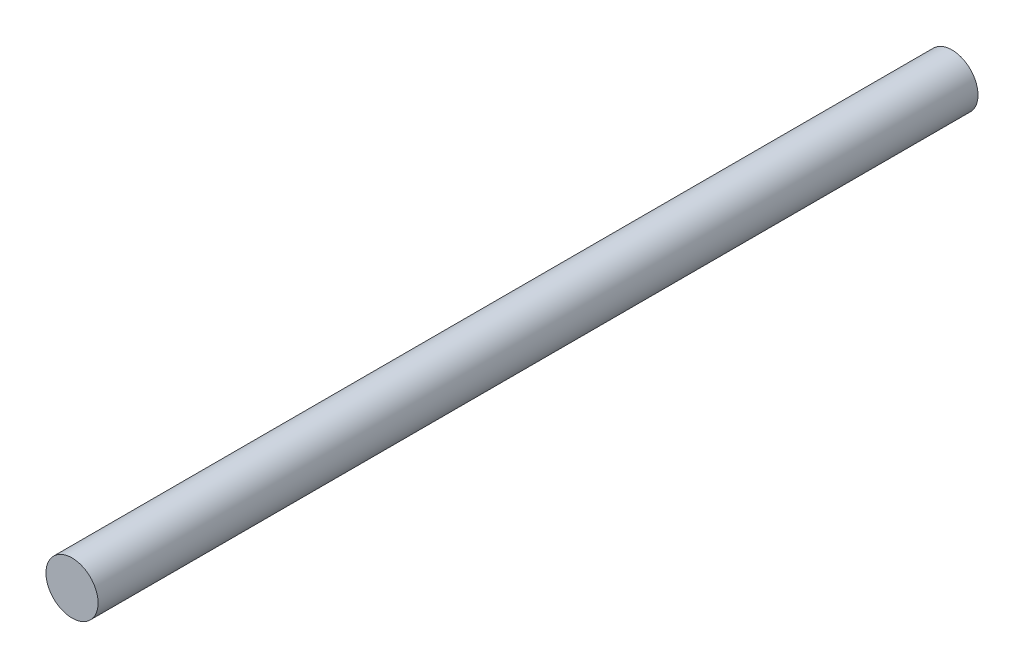
ISO-10303-21;
HEADER;
FILE_DESCRIPTION(('STEP AP214'),'2;1');
FILE_NAME('part.step','',(''),(''),'','','');
FILE_SCHEMA(('AUTOMOTIVE_DESIGN { 1 0 10303 214 1 1 1 1 }'));
ENDSEC;
DATA;
#1=APPLICATION_CONTEXT('core data for automotive mechanical design processes');
#2=APPLICATION_PROTOCOL_DEFINITION('international standard','automotive_design',2000,#1);
#3=PRODUCT_CONTEXT('',#1,'mechanical');
#4=PRODUCT('Part','Part','',(#3));
#5=PRODUCT_RELATED_PRODUCT_CATEGORY('part','',(#4));
#6=PRODUCT_DEFINITION_FORMATION('','',#4);
#7=PRODUCT_DEFINITION_CONTEXT('part definition',#1,'design');
#8=PRODUCT_DEFINITION('design','',#6,#7);
#9=PRODUCT_DEFINITION_SHAPE('','',#8);
#10=(LENGTH_UNIT() NAMED_UNIT(*) SI_UNIT(.MILLI.,.METRE.));
#11=(NAMED_UNIT(*) PLANE_ANGLE_UNIT() SI_UNIT($,.RADIAN.));
#12=(NAMED_UNIT(*) SI_UNIT($,.STERADIAN.) SOLID_ANGLE_UNIT());
#13=UNCERTAINTY_MEASURE_WITH_UNIT(LENGTH_MEASURE(1.E-05),#10,'distance_accuracy_value','');
#14=(GEOMETRIC_REPRESENTATION_CONTEXT(3) GLOBAL_UNCERTAINTY_ASSIGNED_CONTEXT((#13)) GLOBAL_UNIT_ASSIGNED_CONTEXT((#10,
#11,#12)) REPRESENTATION_CONTEXT('',''));
#15=CARTESIAN_POINT('',(0.,0.,0.));
#16=DIRECTION('',(0.,0.,1.));
#17=DIRECTION('',(1.,0.,0.));
#18=AXIS2_PLACEMENT_3D('',#15,#16,#17);
#19=CARTESIAN_POINT('',(0.,0.,135.));
#20=DIRECTION('',(0.,0.,-1.));
#21=DIRECTION('',(-1.,0.,0.));
#22=AXIS2_PLACEMENT_3D('',#19,#20,#21);
#23=CYLINDRICAL_SURFACE('',#22,4.);
#24=CARTESIAN_POINT('',(0.,0.,135.));
#25=DIRECTION('',(0.,0.,1.));
#26=DIRECTION('',(1.,0.,0.));
#27=AXIS2_PLACEMENT_3D('',#24,#25,#26);
#28=CIRCLE('',#27,4.);
#29=CARTESIAN_POINT('',(4.,0.,135.));
#30=VERTEX_POINT('',#29);
#31=EDGE_CURVE('E10',#30,#30,#28,.T.);
#32=ORIENTED_EDGE('',*,*,#31,.F.);
#33=EDGE_LOOP('',(#32));
#34=FACE_BOUND('',#33,.T.);
#35=CARTESIAN_POINT('',(0.,0.,0.));
#36=DIRECTION('',(0.,0.,1.));
#37=DIRECTION('',(1.,0.,0.));
#38=AXIS2_PLACEMENT_3D('',#35,#36,#37);
#39=CIRCLE('',#38,4.);
#40=CARTESIAN_POINT('',(4.,0.,0.));
#41=VERTEX_POINT('',#40);
#42=EDGE_CURVE('E34',#41,#41,#39,.T.);
#43=ORIENTED_EDGE('',*,*,#42,.T.);
#44=EDGE_LOOP('',(#43));
#45=FACE_BOUND('',#44,.T.);
#46=ADVANCED_FACE('F31',(#34,#45),#23,.T.);
#47=CARTESIAN_POINT('',(0.,0.,135.));
#48=DIRECTION('',(0.,0.,1.));
#49=DIRECTION('',(1.,0.,0.));
#50=AXIS2_PLACEMENT_3D('',#47,#48,#49);
#51=PLANE('',#50);
#52=ORIENTED_EDGE('',*,*,#31,.T.);
#53=EDGE_LOOP('',(#52));
#54=FACE_BOUND('',#53,.T.);
#55=ADVANCED_FACE('F46',(#54),#51,.T.);
#56=CARTESIAN_POINT('',(0.,0.,0.));
#57=DIRECTION('',(0.,0.,1.));
#58=DIRECTION('',(1.,0.,0.));
#59=AXIS2_PLACEMENT_3D('',#56,#57,#58);
#60=PLANE('',#59);
#61=ORIENTED_EDGE('',*,*,#42,.F.);
#62=EDGE_LOOP('',(#61));
#63=FACE_BOUND('',#62,.T.);
#64=ADVANCED_FACE('F44',(#63),#60,.F.);
#65=CLOSED_SHELL('',(#46,#55,#64));
#66=MANIFOLD_SOLID_BREP('B2',#65);
#67=ADVANCED_BREP_SHAPE_REPRESENTATION('',(#18,#66),#14);
#68=SHAPE_DEFINITION_REPRESENTATION(#9,#67);
ENDSEC;
END-ISO-10303-21;
